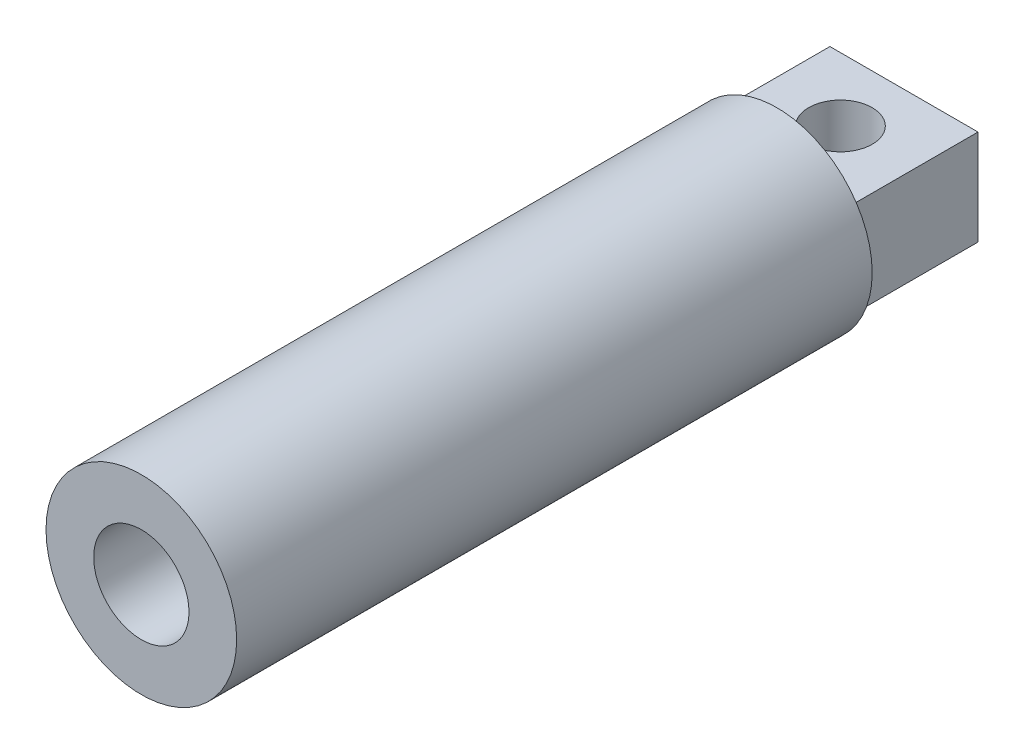
ISO-10303-21;
HEADER;
FILE_DESCRIPTION(('STEP AP214'),'2;1');
FILE_NAME('part.step','',(''),(''),'','','');
FILE_SCHEMA(('AUTOMOTIVE_DESIGN { 1 0 10303 214 1 1 1 1 }'));
ENDSEC;
DATA;
#1=APPLICATION_CONTEXT('core data for automotive mechanical design processes');
#2=APPLICATION_PROTOCOL_DEFINITION('international standard','automotive_design',2000,#1);
#3=PRODUCT_CONTEXT('',#1,'mechanical');
#4=PRODUCT('Part','Part','',(#3));
#5=PRODUCT_RELATED_PRODUCT_CATEGORY('part','',(#4));
#6=PRODUCT_DEFINITION_FORMATION('','',#4);
#7=PRODUCT_DEFINITION_CONTEXT('part definition',#1,'design');
#8=PRODUCT_DEFINITION('design','',#6,#7);
#9=PRODUCT_DEFINITION_SHAPE('','',#8);
#10=(LENGTH_UNIT() NAMED_UNIT(*) SI_UNIT(.MILLI.,.METRE.));
#11=(NAMED_UNIT(*) PLANE_ANGLE_UNIT() SI_UNIT($,.RADIAN.));
#12=(NAMED_UNIT(*) SI_UNIT($,.STERADIAN.) SOLID_ANGLE_UNIT());
#13=UNCERTAINTY_MEASURE_WITH_UNIT(LENGTH_MEASURE(1.E-05),#10,'distance_accuracy_value','');
#14=(GEOMETRIC_REPRESENTATION_CONTEXT(3) GLOBAL_UNCERTAINTY_ASSIGNED_CONTEXT((#13)) GLOBAL_UNIT_ASSIGNED_CONTEXT((#10,
#11,#12)) REPRESENTATION_CONTEXT('',''));
#15=CARTESIAN_POINT('',(0.,0.,0.));
#16=DIRECTION('',(0.,0.,1.));
#17=DIRECTION('',(1.,0.,0.));
#18=AXIS2_PLACEMENT_3D('',#15,#16,#17);
#19=CARTESIAN_POINT('',(0.,0.,0.));
#20=DIRECTION('',(0.,0.,1.));
#21=DIRECTION('',(1.,0.,0.));
#22=AXIS2_PLACEMENT_3D('',#19,#20,#21);
#23=PLANE('',#22);
#24=CARTESIAN_POINT('',(0.,0.,0.));
#25=DIRECTION('',(0.,0.,1.));
#26=DIRECTION('',(1.,0.,0.));
#27=AXIS2_PLACEMENT_3D('',#24,#25,#26);
#28=CIRCLE('',#27,15.);
#29=CARTESIAN_POINT('',(15.,0.,0.));
#30=VERTEX_POINT('',#29);
#31=EDGE_CURVE('E102',#30,#30,#28,.T.);
#32=ORIENTED_EDGE('',*,*,#31,.F.);
#33=EDGE_LOOP('',(#32));
#34=FACE_BOUND('',#33,.T.);
#35=DIRECTION('',(0.,-1.,0.));
#36=VECTOR('',#35,1.);
#37=CARTESIAN_POINT('',(11.6502516644573,0.,0.));
#38=LINE('',#37,#36);
#39=CARTESIAN_POINT('',(11.6502516644573,7.5,0.));
#40=VERTEX_POINT('',#39);
#41=CARTESIAN_POINT('',(11.6502516644573,-7.5,0.));
#42=VERTEX_POINT('',#41);
#43=EDGE_CURVE('E11',#40,#42,#38,.T.);
#44=ORIENTED_EDGE('',*,*,#43,.F.);
#45=DIRECTION('',(1.,0.,0.));
#46=VECTOR('',#45,1.);
#47=CARTESIAN_POINT('',(0.,7.5,0.));
#48=LINE('',#47,#46);
#49=CARTESIAN_POINT('',(-11.6502516644573,7.5,0.));
#50=VERTEX_POINT('',#49);
#51=EDGE_CURVE('E48',#50,#40,#48,.T.);
#52=ORIENTED_EDGE('',*,*,#51,.F.);
#53=DIRECTION('',(0.,1.,0.));
#54=VECTOR('',#53,1.);
#55=CARTESIAN_POINT('',(-11.6502516644573,0.,0.));
#56=LINE('',#55,#54);
#57=CARTESIAN_POINT('',(-11.6502516644573,-7.5,0.));
#58=VERTEX_POINT('',#57);
#59=EDGE_CURVE('E41',#58,#50,#56,.T.);
#60=ORIENTED_EDGE('',*,*,#59,.F.);
#61=DIRECTION('',(1.,0.,0.));
#62=VECTOR('',#61,1.);
#63=CARTESIAN_POINT('',(0.,-7.5,0.));
#64=LINE('',#63,#62);
#65=EDGE_CURVE('E55',#58,#42,#64,.T.);
#66=ORIENTED_EDGE('',*,*,#65,.T.);
#67=EDGE_LOOP('',(#44,#52,#60,#66));
#68=FACE_BOUND('',#67,.T.);
#69=ADVANCED_FACE('F33',(#34,#68),#23,.F.);
#70=CARTESIAN_POINT('',(0.,0.,-30.));
#71=DIRECTION('',(0.,0.,1.));
#72=DIRECTION('',(1.,0.,0.));
#73=AXIS2_PLACEMENT_3D('',#70,#71,#72);
#74=CYLINDRICAL_SURFACE('',#73,7.5);
#75=CARTESIAN_POINT('',(0.,0.,100.));
#76=DIRECTION('',(0.,0.,1.));
#77=DIRECTION('',(1.,0.,0.));
#78=AXIS2_PLACEMENT_3D('',#75,#76,#77);
#79=CIRCLE('',#78,7.5);
#80=CARTESIAN_POINT('',(7.5,0.,100.));
#81=VERTEX_POINT('',#80);
#82=EDGE_CURVE('E99',#81,#81,#79,.T.);
#83=ORIENTED_EDGE('',*,*,#82,.T.);
#84=EDGE_LOOP('',(#83));
#85=FACE_BOUND('',#84,.T.);
#86=CARTESIAN_POINT('',(0.,0.,20.));
#87=DIRECTION('',(0.,0.,-1.));
#88=DIRECTION('',(-1.,0.,0.));
#89=AXIS2_PLACEMENT_3D('',#86,#87,#88);
#90=CIRCLE('',#89,7.5);
#91=CARTESIAN_POINT('',(-7.5,0.,20.));
#92=VERTEX_POINT('',#91);
#93=EDGE_CURVE('E106',#92,#92,#90,.F.);
#94=ORIENTED_EDGE('',*,*,#93,.F.);
#95=EDGE_LOOP('',(#94));
#96=FACE_BOUND('',#95,.T.);
#97=ADVANCED_FACE('F136',(#85,#96),#74,.F.);
#98=CARTESIAN_POINT('',(0.,0.,100.));
#99=DIRECTION('',(0.,0.,-1.));
#100=DIRECTION('',(-1.,0.,0.));
#101=AXIS2_PLACEMENT_3D('',#98,#99,#100);
#102=CYLINDRICAL_SURFACE('',#101,15.);
#103=CARTESIAN_POINT('',(0.,0.,100.));
#104=DIRECTION('',(0.,0.,1.));
#105=DIRECTION('',(1.,0.,0.));
#106=AXIS2_PLACEMENT_3D('',#103,#104,#105);
#107=CIRCLE('',#106,15.);
#108=CARTESIAN_POINT('',(15.,0.,100.));
#109=VERTEX_POINT('',#108);
#110=EDGE_CURVE('E103',#109,#109,#107,.T.);
#111=ORIENTED_EDGE('',*,*,#110,.F.);
#112=EDGE_LOOP('',(#111));
#113=FACE_BOUND('',#112,.T.);
#114=ORIENTED_EDGE('',*,*,#31,.T.);
#115=EDGE_LOOP('',(#114));
#116=FACE_BOUND('',#115,.T.);
#117=ADVANCED_FACE('F35',(#113,#116),#102,.T.);
#118=CARTESIAN_POINT('',(0.,0.,100.));
#119=DIRECTION('',(0.,0.,1.));
#120=DIRECTION('',(1.,0.,0.));
#121=AXIS2_PLACEMENT_3D('',#118,#119,#120);
#122=PLANE('',#121);
#123=ORIENTED_EDGE('',*,*,#82,.F.);
#124=EDGE_LOOP('',(#123));
#125=FACE_BOUND('',#124,.T.);
#126=ORIENTED_EDGE('',*,*,#110,.T.);
#127=EDGE_LOOP('',(#126));
#128=FACE_BOUND('',#127,.T.);
#129=ADVANCED_FACE('F145',(#125,#128),#122,.T.);
#130=CARTESIAN_POINT('',(-11.6502516644573,7.5,20.));
#131=DIRECTION('',(0.,0.,-1.));
#132=DIRECTION('',(-1.,0.,0.));
#133=AXIS2_PLACEMENT_3D('',#130,#131,#132);
#134=PLANE('',#133);
#135=ORIENTED_EDGE('',*,*,#93,.T.);
#136=EDGE_LOOP('',(#135));
#137=FACE_BOUND('',#136,.T.);
#138=ADVANCED_FACE('F147',(#137),#134,.F.);
#139=CARTESIAN_POINT('',(11.6502516644573,7.5,20.));
#140=DIRECTION('',(-1.,0.,0.));
#141=DIRECTION('',(0.,0.,1.));
#142=AXIS2_PLACEMENT_3D('',#139,#140,#141);
#143=PLANE('',#142);
#144=DIRECTION('',(0.,0.,-1.));
#145=VECTOR('',#144,1.);
#146=CARTESIAN_POINT('',(11.6502516644573,7.5,20.));
#147=LINE('',#146,#145);
#148=CARTESIAN_POINT('',(11.6502516644573,7.5,-20.));
#149=VERTEX_POINT('',#148);
#150=EDGE_CURVE('E71',#40,#149,#147,.T.);
#151=ORIENTED_EDGE('',*,*,#150,.F.);
#152=ORIENTED_EDGE('',*,*,#43,.T.);
#153=DIRECTION('',(0.,0.,-1.));
#154=VECTOR('',#153,1.);
#155=CARTESIAN_POINT('',(11.6502516644573,-7.5,20.));
#156=LINE('',#155,#154);
#157=CARTESIAN_POINT('',(11.6502516644573,-7.5,-20.));
#158=VERTEX_POINT('',#157);
#159=EDGE_CURVE('E91',#42,#158,#156,.T.);
#160=ORIENTED_EDGE('',*,*,#159,.T.);
#161=DIRECTION('',(0.,-1.,0.));
#162=VECTOR('',#161,1.);
#163=CARTESIAN_POINT('',(11.6502516644573,7.5,-20.));
#164=LINE('',#163,#162);
#165=EDGE_CURVE('E83',#149,#158,#164,.T.);
#166=ORIENTED_EDGE('',*,*,#165,.F.);
#167=EDGE_LOOP('',(#151,#152,#160,#166));
#168=FACE_BOUND('',#167,.T.);
#169=ADVANCED_FACE('F89',(#168),#143,.F.);
#170=CARTESIAN_POINT('',(-11.6502516644573,7.5,20.));
#171=DIRECTION('',(1.,0.,0.));
#172=DIRECTION('',(0.,0.,-1.));
#173=AXIS2_PLACEMENT_3D('',#170,#171,#172);
#174=PLANE('',#173);
#175=DIRECTION('',(0.,0.,1.));
#176=VECTOR('',#175,1.);
#177=CARTESIAN_POINT('',(-11.6502516644573,-7.5,20.));
#178=LINE('',#177,#176);
#179=CARTESIAN_POINT('',(-11.6502516644573,-7.5,-20.));
#180=VERTEX_POINT('',#179);
#181=EDGE_CURVE('E78',#180,#58,#178,.T.);
#182=ORIENTED_EDGE('',*,*,#181,.T.);
#183=ORIENTED_EDGE('',*,*,#59,.T.);
#184=DIRECTION('',(0.,0.,1.));
#185=VECTOR('',#184,1.);
#186=CARTESIAN_POINT('',(-11.6502516644573,7.5,20.));
#187=LINE('',#186,#185);
#188=CARTESIAN_POINT('',(-11.6502516644573,7.5,-20.));
#189=VERTEX_POINT('',#188);
#190=EDGE_CURVE('E87',#189,#50,#187,.T.);
#191=ORIENTED_EDGE('',*,*,#190,.F.);
#192=DIRECTION('',(0.,-1.,0.));
#193=VECTOR('',#192,1.);
#194=CARTESIAN_POINT('',(-11.6502516644573,7.5,-20.));
#195=LINE('',#194,#193);
#196=EDGE_CURVE('E85',#189,#180,#195,.T.);
#197=ORIENTED_EDGE('',*,*,#196,.T.);
#198=EDGE_LOOP('',(#182,#183,#191,#197));
#199=FACE_BOUND('',#198,.T.);
#200=ADVANCED_FACE('F113',(#199),#174,.F.);
#201=CARTESIAN_POINT('',(0.,7.5,0.));
#202=DIRECTION('',(0.,-1.,0.));
#203=DIRECTION('',(0.,0.,-1.));
#204=AXIS2_PLACEMENT_3D('',#201,#202,#203);
#205=PLANE('',#204);
#206=CARTESIAN_POINT('',(0.,7.5,-10.));
#207=DIRECTION('',(0.,1.,0.));
#208=DIRECTION('',(0.,0.,1.));
#209=AXIS2_PLACEMENT_3D('',#206,#207,#208);
#210=CIRCLE('',#209,5.);
#211=CARTESIAN_POINT('',(0.,7.5,-5.));
#212=VERTEX_POINT('',#211);
#213=EDGE_CURVE('E119',#212,#212,#210,.T.);
#214=ORIENTED_EDGE('',*,*,#213,.F.);
#215=EDGE_LOOP('',(#214));
#216=FACE_BOUND('',#215,.T.);
#217=ORIENTED_EDGE('',*,*,#190,.T.);
#218=ORIENTED_EDGE('',*,*,#51,.T.);
#219=ORIENTED_EDGE('',*,*,#150,.T.);
#220=DIRECTION('',(-1.,0.,0.));
#221=VECTOR('',#220,1.);
#222=CARTESIAN_POINT('',(-11.6502516644573,7.5,-20.));
#223=LINE('',#222,#221);
#224=EDGE_CURVE('E74',#149,#189,#223,.T.);
#225=ORIENTED_EDGE('',*,*,#224,.T.);
#226=EDGE_LOOP('',(#217,#218,#219,#225));
#227=FACE_BOUND('',#226,.T.);
#228=ADVANCED_FACE('F73',(#216,#227),#205,.F.);
#229=CARTESIAN_POINT('',(0.,-7.5,0.));
#230=DIRECTION('',(0.,-1.,0.));
#231=DIRECTION('',(0.,0.,-1.));
#232=AXIS2_PLACEMENT_3D('',#229,#230,#231);
#233=PLANE('',#232);
#234=CARTESIAN_POINT('',(0.,-7.5,-10.));
#235=DIRECTION('',(0.,1.,0.));
#236=DIRECTION('',(0.,0.,1.));
#237=AXIS2_PLACEMENT_3D('',#234,#235,#236);
#238=CIRCLE('',#237,5.);
#239=CARTESIAN_POINT('',(0.,-7.5,-5.));
#240=VERTEX_POINT('',#239);
#241=EDGE_CURVE('E202',#240,#240,#238,.T.);
#242=ORIENTED_EDGE('',*,*,#241,.T.);
#243=EDGE_LOOP('',(#242));
#244=FACE_BOUND('',#243,.T.);
#245=ORIENTED_EDGE('',*,*,#65,.F.);
#246=ORIENTED_EDGE('',*,*,#181,.F.);
#247=DIRECTION('',(-1.,0.,0.));
#248=VECTOR('',#247,1.);
#249=CARTESIAN_POINT('',(-11.6502516644573,-7.5,-20.));
#250=LINE('',#249,#248);
#251=EDGE_CURVE('E118',#158,#180,#250,.T.);
#252=ORIENTED_EDGE('',*,*,#251,.F.);
#253=ORIENTED_EDGE('',*,*,#159,.F.);
#254=EDGE_LOOP('',(#245,#246,#252,#253));
#255=FACE_BOUND('',#254,.T.);
#256=ADVANCED_FACE('F121',(#244,#255),#233,.T.);
#257=CARTESIAN_POINT('',(-11.6502516644573,7.5,-20.));
#258=DIRECTION('',(0.,0.,1.));
#259=DIRECTION('',(1.,0.,0.));
#260=AXIS2_PLACEMENT_3D('',#257,#258,#259);
#261=PLANE('',#260);
#262=ORIENTED_EDGE('',*,*,#251,.T.);
#263=ORIENTED_EDGE('',*,*,#196,.F.);
#264=ORIENTED_EDGE('',*,*,#224,.F.);
#265=ORIENTED_EDGE('',*,*,#165,.T.);
#266=EDGE_LOOP('',(#262,#263,#264,#265));
#267=FACE_BOUND('',#266,.T.);
#268=ADVANCED_FACE('F82',(#267),#261,.F.);
#269=CARTESIAN_POINT('',(0.,7.5,-10.));
#270=DIRECTION('',(0.,-1.,0.));
#271=DIRECTION('',(0.,0.,-1.));
#272=AXIS2_PLACEMENT_3D('',#269,#270,#271);
#273=CYLINDRICAL_SURFACE('',#272,5.);
#274=ORIENTED_EDGE('',*,*,#213,.T.);
#275=EDGE_LOOP('',(#274));
#276=FACE_BOUND('',#275,.T.);
#277=ORIENTED_EDGE('',*,*,#241,.F.);
#278=EDGE_LOOP('',(#277));
#279=FACE_BOUND('',#278,.T.);
#280=ADVANCED_FACE('F129',(#276,#279),#273,.F.);
#281=CLOSED_SHELL('',(#69,#97,#117,#129,#138,#169,#200,#228,#256,#268,#280));
#282=MANIFOLD_SOLID_BREP('B2',#281);
#283=ADVANCED_BREP_SHAPE_REPRESENTATION('',(#18,#282),#14);
#284=SHAPE_DEFINITION_REPRESENTATION(#9,#283);
ENDSEC;
END-ISO-10303-21;
